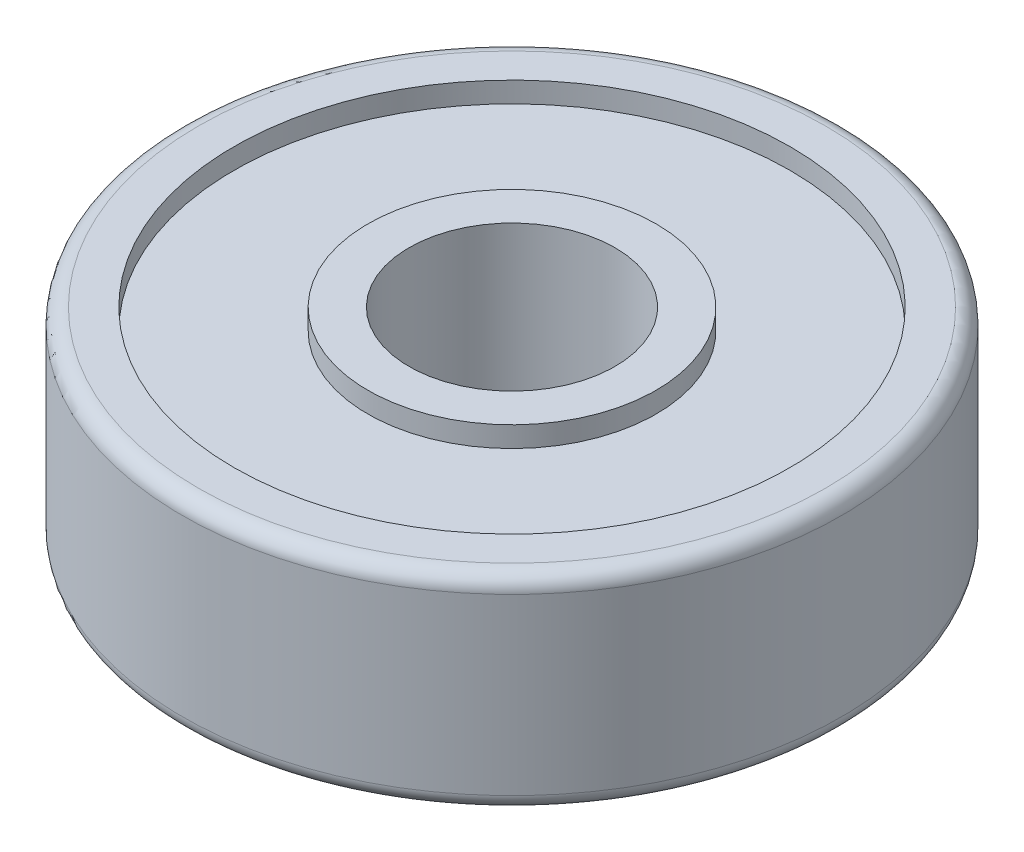
ISO-10303-21;
HEADER;
FILE_DESCRIPTION(('STEP AP214'),'2;1');
FILE_NAME('part.step','',(''),(''),'','','');
FILE_SCHEMA(('AUTOMOTIVE_DESIGN { 1 0 10303 214 1 1 1 1 }'));
ENDSEC;
DATA;
#1=APPLICATION_CONTEXT('core data for automotive mechanical design processes');
#2=APPLICATION_PROTOCOL_DEFINITION('international standard','automotive_design',2000,#1);
#3=PRODUCT_CONTEXT('',#1,'mechanical');
#4=PRODUCT('Part','Part','',(#3));
#5=PRODUCT_RELATED_PRODUCT_CATEGORY('part','',(#4));
#6=PRODUCT_DEFINITION_FORMATION('','',#4);
#7=PRODUCT_DEFINITION_CONTEXT('part definition',#1,'design');
#8=PRODUCT_DEFINITION('design','',#6,#7);
#9=PRODUCT_DEFINITION_SHAPE('','',#8);
#10=(LENGTH_UNIT() NAMED_UNIT(*) SI_UNIT(.MILLI.,.METRE.));
#11=(NAMED_UNIT(*) PLANE_ANGLE_UNIT() SI_UNIT($,.RADIAN.));
#12=(NAMED_UNIT(*) SI_UNIT($,.STERADIAN.) SOLID_ANGLE_UNIT());
#13=UNCERTAINTY_MEASURE_WITH_UNIT(LENGTH_MEASURE(1.E-05),#10,'distance_accuracy_value','');
#14=(GEOMETRIC_REPRESENTATION_CONTEXT(3) GLOBAL_UNCERTAINTY_ASSIGNED_CONTEXT((#13)) GLOBAL_UNIT_ASSIGNED_CONTEXT((#10,
#11,#12)) REPRESENTATION_CONTEXT('',''));
#15=CARTESIAN_POINT('',(0.,0.,0.));
#16=DIRECTION('',(0.,0.,1.));
#17=DIRECTION('',(1.,0.,0.));
#18=AXIS2_PLACEMENT_3D('',#15,#16,#17);
#19=CARTESIAN_POINT('',(0.,2.75,0.));
#20=DIRECTION('',(0.,-1.,0.));
#21=DIRECTION('',(0.,0.,-1.));
#22=AXIS2_PLACEMENT_3D('',#19,#20,#21);
#23=CYLINDRICAL_SURFACE('',#22,2.5);
#24=CARTESIAN_POINT('',(0.,-2.5,0.));
#25=DIRECTION('',(0.,-1.,0.));
#26=DIRECTION('',(0.,0.,-1.));
#27=AXIS2_PLACEMENT_3D('',#24,#25,#26);
#28=CIRCLE('',#27,2.5);
#29=CARTESIAN_POINT('',(0.,-2.5,-2.5));
#30=VERTEX_POINT('',#29);
#31=EDGE_CURVE('E272',#30,#30,#28,.F.);
#32=ORIENTED_EDGE('',*,*,#31,.F.);
#33=EDGE_LOOP('',(#32));
#34=FACE_BOUND('',#33,.T.);
#35=CARTESIAN_POINT('',(0.,2.5,0.));
#36=DIRECTION('',(0.,-1.,0.));
#37=DIRECTION('',(0.,0.,-1.));
#38=AXIS2_PLACEMENT_3D('',#35,#36,#37);
#39=CIRCLE('',#38,2.5);
#40=CARTESIAN_POINT('',(0.,2.5,-2.5));
#41=VERTEX_POINT('',#40);
#42=EDGE_CURVE('E275',#41,#41,#39,.F.);
#43=ORIENTED_EDGE('',*,*,#42,.T.);
#44=EDGE_LOOP('',(#43));
#45=FACE_BOUND('',#44,.T.);
#46=ADVANCED_FACE('F17',(#34,#45),#23,.F.);
#47=CARTESIAN_POINT('',(0.,-2.5,0.));
#48=DIRECTION('',(0.,-1.,0.));
#49=DIRECTION('',(0.,0.,-1.));
#50=AXIS2_PLACEMENT_3D('',#47,#48,#49);
#51=PLANE('',#50);
#52=ORIENTED_EDGE('',*,*,#31,.T.);
#53=EDGE_LOOP('',(#52));
#54=FACE_BOUND('',#53,.T.);
#55=CARTESIAN_POINT('',(0.,-2.5,0.));
#56=DIRECTION('',(0.,-1.,0.));
#57=DIRECTION('',(0.,0.,-1.));
#58=AXIS2_PLACEMENT_3D('',#55,#56,#57);
#59=CIRCLE('',#58,3.5);
#60=CARTESIAN_POINT('',(0.,-2.5,-3.5));
#61=VERTEX_POINT('',#60);
#62=EDGE_CURVE('E276',#61,#61,#59,.F.);
#63=ORIENTED_EDGE('',*,*,#62,.F.);
#64=EDGE_LOOP('',(#63));
#65=FACE_BOUND('',#64,.T.);
#66=ADVANCED_FACE('F239',(#54,#65),#51,.T.);
#67=CARTESIAN_POINT('',(0.,2.5,0.));
#68=DIRECTION('',(0.,-1.,0.));
#69=DIRECTION('',(0.,0.,-1.));
#70=AXIS2_PLACEMENT_3D('',#67,#68,#69);
#71=PLANE('',#70);
#72=ORIENTED_EDGE('',*,*,#42,.F.);
#73=EDGE_LOOP('',(#72));
#74=FACE_BOUND('',#73,.T.);
#75=CARTESIAN_POINT('',(0.,2.5,0.));
#76=DIRECTION('',(0.,-1.,0.));
#77=DIRECTION('',(0.,0.,-1.));
#78=AXIS2_PLACEMENT_3D('',#75,#76,#77);
#79=CIRCLE('',#78,3.5);
#80=CARTESIAN_POINT('',(0.,2.5,-3.5));
#81=VERTEX_POINT('',#80);
#82=EDGE_CURVE('E279',#81,#81,#79,.T.);
#83=ORIENTED_EDGE('',*,*,#82,.F.);
#84=EDGE_LOOP('',(#83));
#85=FACE_BOUND('',#84,.T.);
#86=ADVANCED_FACE('F230',(#74,#85),#71,.F.);
#87=CARTESIAN_POINT('',(0.,2.75,0.));
#88=DIRECTION('',(0.,-1.,0.));
#89=DIRECTION('',(0.,0.,-1.));
#90=AXIS2_PLACEMENT_3D('',#87,#88,#89);
#91=CYLINDRICAL_SURFACE('',#90,3.5);
#92=CARTESIAN_POINT('',(0.,-2.,0.));
#93=DIRECTION('',(0.,-1.,0.));
#94=DIRECTION('',(0.,0.,-1.));
#95=AXIS2_PLACEMENT_3D('',#92,#93,#94);
#96=CIRCLE('',#95,3.5);
#97=CARTESIAN_POINT('',(0.,-2.,-3.5));
#98=VERTEX_POINT('',#97);
#99=EDGE_CURVE('E293',#98,#98,#96,.F.);
#100=ORIENTED_EDGE('',*,*,#99,.F.);
#101=EDGE_LOOP('',(#100));
#102=FACE_BOUND('',#101,.T.);
#103=ORIENTED_EDGE('',*,*,#62,.T.);
#104=EDGE_LOOP('',(#103));
#105=FACE_BOUND('',#104,.T.);
#106=ADVANCED_FACE('F221',(#102,#105),#91,.T.);
#107=CARTESIAN_POINT('',(0.,2.75,0.));
#108=DIRECTION('',(0.,-1.,0.));
#109=DIRECTION('',(0.,0.,-1.));
#110=AXIS2_PLACEMENT_3D('',#107,#108,#109);
#111=CYLINDRICAL_SURFACE('',#110,3.5);
#112=ORIENTED_EDGE('',*,*,#82,.T.);
#113=EDGE_LOOP('',(#112));
#114=FACE_BOUND('',#113,.T.);
#115=CARTESIAN_POINT('',(0.,2.,0.));
#116=DIRECTION('',(0.,-1.,0.));
#117=DIRECTION('',(0.,0.,-1.));
#118=AXIS2_PLACEMENT_3D('',#115,#116,#117);
#119=CIRCLE('',#118,3.5);
#120=CARTESIAN_POINT('',(0.,2.,-3.5));
#121=VERTEX_POINT('',#120);
#122=EDGE_CURVE('E296',#121,#121,#119,.F.);
#123=ORIENTED_EDGE('',*,*,#122,.T.);
#124=EDGE_LOOP('',(#123));
#125=FACE_BOUND('',#124,.T.);
#126=ADVANCED_FACE('F210',(#114,#125),#111,.T.);
#127=CARTESIAN_POINT('',(0.,-2.,0.));
#128=DIRECTION('',(0.,-1.,0.));
#129=DIRECTION('',(0.,0.,-1.));
#130=AXIS2_PLACEMENT_3D('',#127,#128,#129);
#131=PLANE('',#130);
#132=ORIENTED_EDGE('',*,*,#99,.T.);
#133=EDGE_LOOP('',(#132));
#134=FACE_BOUND('',#133,.T.);
#135=CARTESIAN_POINT('',(0.,-2.,0.));
#136=DIRECTION('',(0.,-1.,0.));
#137=DIRECTION('',(0.,0.,-1.));
#138=AXIS2_PLACEMENT_3D('',#135,#136,#137);
#139=CIRCLE('',#138,6.75);
#140=CARTESIAN_POINT('',(0.,-2.,-6.75));
#141=VERTEX_POINT('',#140);
#142=EDGE_CURVE('E299',#141,#141,#139,.T.);
#143=ORIENTED_EDGE('',*,*,#142,.T.);
#144=EDGE_LOOP('',(#143));
#145=FACE_BOUND('',#144,.T.);
#146=ADVANCED_FACE('F200',(#134,#145),#131,.T.);
#147=CARTESIAN_POINT('',(0.,2.,0.));
#148=DIRECTION('',(0.,-1.,0.));
#149=DIRECTION('',(0.,0.,-1.));
#150=AXIS2_PLACEMENT_3D('',#147,#148,#149);
#151=PLANE('',#150);
#152=ORIENTED_EDGE('',*,*,#122,.F.);
#153=EDGE_LOOP('',(#152));
#154=FACE_BOUND('',#153,.T.);
#155=CARTESIAN_POINT('',(0.,2.,0.));
#156=DIRECTION('',(0.,-1.,0.));
#157=DIRECTION('',(0.,0.,-1.));
#158=AXIS2_PLACEMENT_3D('',#155,#156,#157);
#159=CIRCLE('',#158,6.75);
#160=CARTESIAN_POINT('',(0.,2.,-6.75));
#161=VERTEX_POINT('',#160);
#162=EDGE_CURVE('E302',#161,#161,#159,.F.);
#163=ORIENTED_EDGE('',*,*,#162,.T.);
#164=EDGE_LOOP('',(#163));
#165=FACE_BOUND('',#164,.T.);
#166=ADVANCED_FACE('F190',(#154,#165),#151,.F.);
#167=CARTESIAN_POINT('',(0.,2.75,0.));
#168=DIRECTION('',(0.,-1.,0.));
#169=DIRECTION('',(0.,0.,-1.));
#170=AXIS2_PLACEMENT_3D('',#167,#168,#169);
#171=CYLINDRICAL_SURFACE('',#170,6.75);
#172=CARTESIAN_POINT('',(0.,-2.5,0.));
#173=DIRECTION('',(0.,-1.,0.));
#174=DIRECTION('',(0.,0.,-1.));
#175=AXIS2_PLACEMENT_3D('',#172,#173,#174);
#176=CIRCLE('',#175,6.75);
#177=CARTESIAN_POINT('',(0.,-2.5,-6.75));
#178=VERTEX_POINT('',#177);
#179=EDGE_CURVE('E52',#178,#178,#176,.F.);
#180=ORIENTED_EDGE('',*,*,#179,.F.);
#181=EDGE_LOOP('',(#180));
#182=FACE_BOUND('',#181,.T.);
#183=ORIENTED_EDGE('',*,*,#142,.F.);
#184=EDGE_LOOP('',(#183));
#185=FACE_BOUND('',#184,.T.);
#186=ADVANCED_FACE('F181',(#182,#185),#171,.F.);
#187=CARTESIAN_POINT('',(0.,2.75,0.));
#188=DIRECTION('',(0.,-1.,0.));
#189=DIRECTION('',(0.,0.,-1.));
#190=AXIS2_PLACEMENT_3D('',#187,#188,#189);
#191=CYLINDRICAL_SURFACE('',#190,6.75);
#192=ORIENTED_EDGE('',*,*,#162,.F.);
#193=EDGE_LOOP('',(#192));
#194=FACE_BOUND('',#193,.T.);
#195=CARTESIAN_POINT('',(0.,2.5,0.));
#196=DIRECTION('',(0.,-1.,0.));
#197=DIRECTION('',(0.,0.,-1.));
#198=AXIS2_PLACEMENT_3D('',#195,#196,#197);
#199=CIRCLE('',#198,6.75);
#200=CARTESIAN_POINT('',(0.,2.5,-6.75));
#201=VERTEX_POINT('',#200);
#202=EDGE_CURVE('E59',#201,#201,#199,.F.);
#203=ORIENTED_EDGE('',*,*,#202,.T.);
#204=EDGE_LOOP('',(#203));
#205=FACE_BOUND('',#204,.T.);
#206=ADVANCED_FACE('F173',(#194,#205),#191,.F.);
#207=CARTESIAN_POINT('',(0.,-2.5,0.));
#208=DIRECTION('',(0.,-1.,0.));
#209=DIRECTION('',(0.,0.,-1.));
#210=AXIS2_PLACEMENT_3D('',#207,#208,#209);
#211=PLANE('',#210);
#212=ORIENTED_EDGE('',*,*,#179,.T.);
#213=EDGE_LOOP('',(#212));
#214=FACE_BOUND('',#213,.T.);
#215=CARTESIAN_POINT('',(0.,-2.5,0.));
#216=DIRECTION('',(0.,1.,0.));
#217=DIRECTION('',(1.,0.,0.));
#218=AXIS2_PLACEMENT_3D('',#215,#216,#217);
#219=CIRCLE('',#218,7.615);
#220=CARTESIAN_POINT('',(7.615,-2.5,0.));
#221=VERTEX_POINT('',#220);
#222=CARTESIAN_POINT('',(-7.615,-2.5,0.));
#223=VERTEX_POINT('',#222);
#224=EDGE_CURVE('E44',#221,#223,#219,.T.);
#225=ORIENTED_EDGE('',*,*,#224,.F.);
#226=CARTESIAN_POINT('',(0.,-2.5,0.));
#227=DIRECTION('',(0.,1.,0.));
#228=DIRECTION('',(-1.,0.,0.));
#229=AXIS2_PLACEMENT_3D('',#226,#227,#228);
#230=CIRCLE('',#229,7.615);
#231=EDGE_CURVE('E50',#223,#221,#230,.T.);
#232=ORIENTED_EDGE('',*,*,#231,.F.);
#233=EDGE_LOOP('',(#225,#232));
#234=FACE_BOUND('',#233,.T.);
#235=ADVANCED_FACE('F49',(#214,#234),#211,.T.);
#236=CARTESIAN_POINT('',(0.,2.5,0.));
#237=DIRECTION('',(0.,-1.,0.));
#238=DIRECTION('',(0.,0.,-1.));
#239=AXIS2_PLACEMENT_3D('',#236,#237,#238);
#240=PLANE('',#239);
#241=ORIENTED_EDGE('',*,*,#202,.F.);
#242=EDGE_LOOP('',(#241));
#243=FACE_BOUND('',#242,.T.);
#244=CARTESIAN_POINT('',(0.,2.5,0.));
#245=DIRECTION('',(0.,-1.,0.));
#246=DIRECTION('',(1.,0.,0.));
#247=AXIS2_PLACEMENT_3D('',#244,#245,#246);
#248=CIRCLE('',#247,7.615);
#249=CARTESIAN_POINT('',(7.615,2.5,0.));
#250=VERTEX_POINT('',#249);
#251=CARTESIAN_POINT('',(-7.615,2.5,0.));
#252=VERTEX_POINT('',#251);
#253=EDGE_CURVE('E58',#250,#252,#248,.T.);
#254=ORIENTED_EDGE('',*,*,#253,.F.);
#255=CARTESIAN_POINT('',(0.,2.5,0.));
#256=DIRECTION('',(0.,-1.,0.));
#257=DIRECTION('',(-1.,0.,0.));
#258=AXIS2_PLACEMENT_3D('',#255,#256,#257);
#259=CIRCLE('',#258,7.615);
#260=EDGE_CURVE('E36',#252,#250,#259,.T.);
#261=ORIENTED_EDGE('',*,*,#260,.F.);
#262=EDGE_LOOP('',(#254,#261));
#263=FACE_BOUND('',#262,.T.);
#264=ADVANCED_FACE('F79',(#243,#263),#240,.F.);
#265=CARTESIAN_POINT('',(0.,-2.115,0.));
#266=DIRECTION('',(0.,-1.,0.));
#267=DIRECTION('',(-0.99999082970482,0.,-0.00428258172899209));
#268=AXIS2_PLACEMENT_3D('',#265,#266,#267);
#269=TOROIDAL_SURFACE('',#268,7.615,0.385);
#270=ORIENTED_EDGE('',*,*,#224,.T.);
#271=ORIENTED_EDGE('',*,*,#231,.T.);
#272=EDGE_LOOP('',(#270,#271));
#273=FACE_BOUND('',#272,.T.);
#274=CARTESIAN_POINT('',(0.,-2.115,0.));
#275=DIRECTION('',(0.,-1.,0.));
#276=DIRECTION('',(0.,0.,-1.));
#277=AXIS2_PLACEMENT_3D('',#274,#275,#276);
#278=CIRCLE('',#277,8.);
#279=CARTESIAN_POINT('',(0.,-2.115,-8.));
#280=VERTEX_POINT('',#279);
#281=EDGE_CURVE('E28',#280,#280,#278,.F.);
#282=ORIENTED_EDGE('',*,*,#281,.F.);
#283=EDGE_LOOP('',(#282));
#284=FACE_BOUND('',#283,.T.);
#285=ADVANCED_FACE('F56',(#273,#284),#269,.T.);
#286=CARTESIAN_POINT('',(0.,2.115,0.));
#287=DIRECTION('',(0.,-1.,0.));
#288=DIRECTION('',(-0.999979984034064,0.,-0.00632704759221277));
#289=AXIS2_PLACEMENT_3D('',#286,#287,#288);
#290=TOROIDAL_SURFACE('',#289,7.615,0.385);
#291=CARTESIAN_POINT('',(0.,2.115,0.));
#292=DIRECTION('',(0.,-1.,0.));
#293=DIRECTION('',(0.,0.,-1.));
#294=AXIS2_PLACEMENT_3D('',#291,#292,#293);
#295=CIRCLE('',#294,8.);
#296=CARTESIAN_POINT('',(0.,2.115,-8.));
#297=VERTEX_POINT('',#296);
#298=EDGE_CURVE('E11',#297,#297,#295,.T.);
#299=ORIENTED_EDGE('',*,*,#298,.F.);
#300=EDGE_LOOP('',(#299));
#301=FACE_BOUND('',#300,.T.);
#302=ORIENTED_EDGE('',*,*,#260,.T.);
#303=ORIENTED_EDGE('',*,*,#253,.T.);
#304=EDGE_LOOP('',(#302,#303));
#305=FACE_BOUND('',#304,.T.);
#306=ADVANCED_FACE('F78',(#301,#305),#290,.T.);
#307=CARTESIAN_POINT('',(0.,2.75,0.));
#308=DIRECTION('',(0.,-1.,0.));
#309=DIRECTION('',(0.,0.,-1.));
#310=AXIS2_PLACEMENT_3D('',#307,#308,#309);
#311=CYLINDRICAL_SURFACE('',#310,8.);
#312=ORIENTED_EDGE('',*,*,#281,.T.);
#313=EDGE_LOOP('',(#312));
#314=FACE_BOUND('',#313,.T.);
#315=ORIENTED_EDGE('',*,*,#298,.T.);
#316=EDGE_LOOP('',(#315));
#317=FACE_BOUND('',#316,.T.);
#318=ADVANCED_FACE('F118',(#314,#317),#311,.T.);
#319=CLOSED_SHELL('',(#46,#66,#86,#106,#126,#146,#166,#186,#206,#235,#264,#285,#306,#318));
#320=CARTESIAN_POINT('',(0.,0.,0.));
#321=DIRECTION('',(0.,-1.,0.));
#322=DIRECTION('',(0.,0.,1.));
#323=AXIS2_PLACEMENT_3D('',#320,#321,#322);
#324=TOROIDAL_SURFACE('',#323,5.2,1.75);
#325=ADVANCED_FACE('F140',(),#324,.F.);
#326=CLOSED_SHELL('',(#325));
#327=ORIENTED_CLOSED_SHELL('',*,#326,.T.);
#328=BREP_WITH_VOIDS('B1',#319,(#327));
#329=ADVANCED_BREP_SHAPE_REPRESENTATION('',(#18,#328),#14);
#330=SHAPE_DEFINITION_REPRESENTATION(#9,#329);
ENDSEC;
END-ISO-10303-21;
